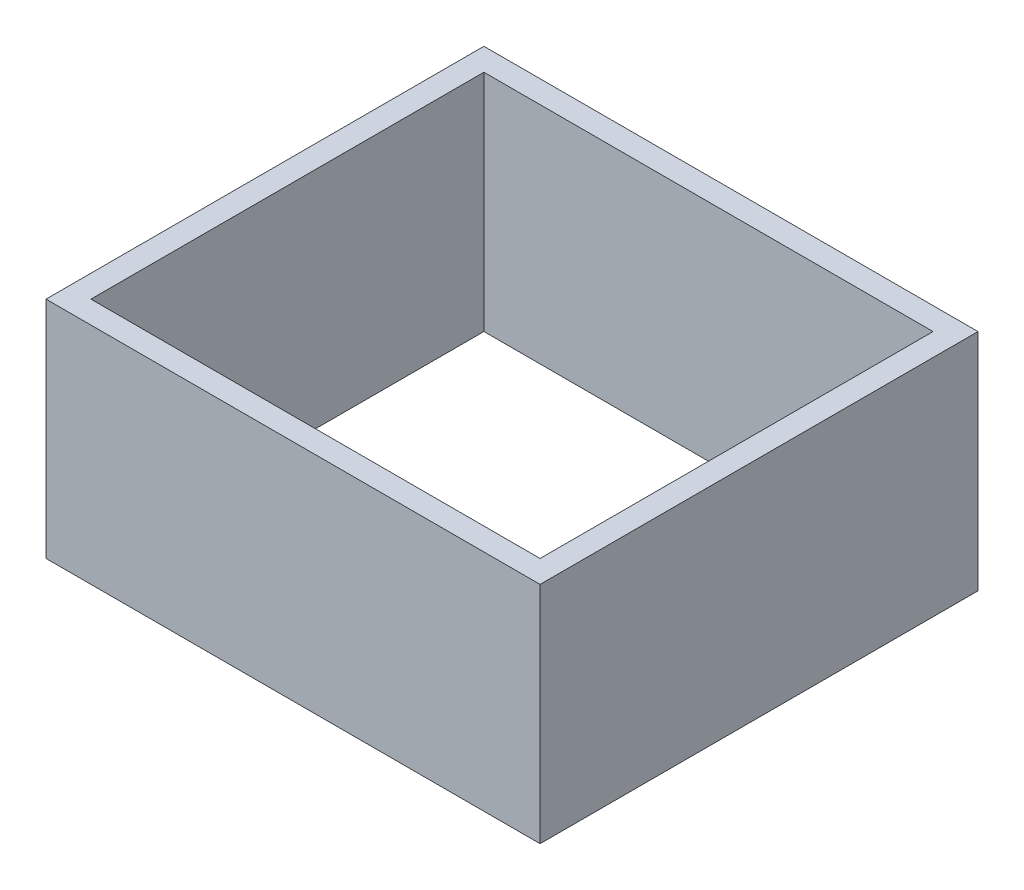
ISO-10303-21;
HEADER;
FILE_DESCRIPTION(('STEP AP214'),'2;1');
FILE_NAME('part.step','',(''),(''),'','','');
FILE_SCHEMA(('AUTOMOTIVE_DESIGN { 1 0 10303 214 1 1 1 1 }'));
ENDSEC;
DATA;
#1=APPLICATION_CONTEXT('core data for automotive mechanical design processes');
#2=APPLICATION_PROTOCOL_DEFINITION('international standard','automotive_design',2000,#1);
#3=PRODUCT_CONTEXT('',#1,'mechanical');
#4=PRODUCT('Part','Part','',(#3));
#5=PRODUCT_RELATED_PRODUCT_CATEGORY('part','',(#4));
#6=PRODUCT_DEFINITION_FORMATION('','',#4);
#7=PRODUCT_DEFINITION_CONTEXT('part definition',#1,'design');
#8=PRODUCT_DEFINITION('design','',#6,#7);
#9=PRODUCT_DEFINITION_SHAPE('','',#8);
#10=(LENGTH_UNIT() NAMED_UNIT(*) SI_UNIT(.MILLI.,.METRE.));
#11=(NAMED_UNIT(*) PLANE_ANGLE_UNIT() SI_UNIT($,.RADIAN.));
#12=(NAMED_UNIT(*) SI_UNIT($,.STERADIAN.) SOLID_ANGLE_UNIT());
#13=UNCERTAINTY_MEASURE_WITH_UNIT(LENGTH_MEASURE(1.E-05),#10,'distance_accuracy_value','');
#14=(GEOMETRIC_REPRESENTATION_CONTEXT(3) GLOBAL_UNCERTAINTY_ASSIGNED_CONTEXT((#13)) GLOBAL_UNIT_ASSIGNED_CONTEXT((#10,
#11,#12)) REPRESENTATION_CONTEXT('',''));
#15=CARTESIAN_POINT('',(0.,0.,0.));
#16=DIRECTION('',(0.,0.,1.));
#17=DIRECTION('',(1.,0.,0.));
#18=AXIS2_PLACEMENT_3D('',#15,#16,#17);
#19=CARTESIAN_POINT('',(-30.9749321294389,25.4,-35.6226457399103));
#20=DIRECTION('',(0.,0.,-1.));
#21=DIRECTION('',(-1.,0.,0.));
#22=AXIS2_PLACEMENT_3D('',#19,#20,#21);
#23=PLANE('',#22);
#24=DIRECTION('',(1.,0.,0.));
#25=VECTOR('',#24,1.);
#26=CARTESIAN_POINT('',(-30.9749321294389,0.,-35.6226457399103));
#27=LINE('',#26,#25);
#28=CARTESIAN_POINT('',(-30.9749321294389,0.,-35.6226457399103));
#29=VERTEX_POINT('',#28);
#30=CARTESIAN_POINT('',(24.9050678705612,0.,-35.6226457399103));
#31=VERTEX_POINT('',#30);
#32=EDGE_CURVE('E148',#29,#31,#27,.T.);
#33=ORIENTED_EDGE('',*,*,#32,.F.);
#34=DIRECTION('',(0.,-1.,0.));
#35=VECTOR('',#34,1.);
#36=CARTESIAN_POINT('',(-30.9749321294389,25.4,-35.6226457399103));
#37=LINE('',#36,#35);
#38=CARTESIAN_POINT('',(-30.9749321294389,25.4,-35.6226457399103));
#39=VERTEX_POINT('',#38);
#40=EDGE_CURVE('E11',#39,#29,#37,.T.);
#41=ORIENTED_EDGE('',*,*,#40,.F.);
#42=DIRECTION('',(1.,0.,0.));
#43=VECTOR('',#42,1.);
#44=CARTESIAN_POINT('',(-30.9749321294389,25.4,-35.6226457399103));
#45=LINE('',#44,#43);
#46=CARTESIAN_POINT('',(24.9050678705612,25.4,-35.6226457399103));
#47=VERTEX_POINT('',#46);
#48=EDGE_CURVE('E154',#39,#47,#45,.T.);
#49=ORIENTED_EDGE('',*,*,#48,.T.);
#50=DIRECTION('',(0.,-1.,0.));
#51=VECTOR('',#50,1.);
#52=CARTESIAN_POINT('',(24.9050678705612,25.4,-35.6226457399103));
#53=LINE('',#52,#51);
#54=EDGE_CURVE('E42',#47,#31,#53,.T.);
#55=ORIENTED_EDGE('',*,*,#54,.T.);
#56=EDGE_LOOP('',(#33,#41,#49,#55));
#57=FACE_BOUND('',#56,.T.);
#58=ADVANCED_FACE('F39',(#57),#23,.T.);
#59=CARTESIAN_POINT('',(-30.9749321294389,25.4,-35.6226457399103));
#60=DIRECTION('',(1.,0.,0.));
#61=DIRECTION('',(0.,0.,-1.));
#62=AXIS2_PLACEMENT_3D('',#59,#60,#61);
#63=PLANE('',#62);
#64=DIRECTION('',(0.,0.,1.));
#65=VECTOR('',#64,1.);
#66=CARTESIAN_POINT('',(-30.9749321294389,0.,-35.6226457399103));
#67=LINE('',#66,#65);
#68=CARTESIAN_POINT('',(-30.9749321294388,0.,13.9073542600897));
#69=VERTEX_POINT('',#68);
#70=EDGE_CURVE('E159',#29,#69,#67,.T.);
#71=ORIENTED_EDGE('',*,*,#70,.T.);
#72=DIRECTION('',(0.,-1.,0.));
#73=VECTOR('',#72,1.);
#74=CARTESIAN_POINT('',(-30.9749321294388,25.4,13.9073542600897));
#75=LINE('',#74,#73);
#76=CARTESIAN_POINT('',(-30.9749321294388,25.4,13.9073542600897));
#77=VERTEX_POINT('',#76);
#78=EDGE_CURVE('E48',#77,#69,#75,.T.);
#79=ORIENTED_EDGE('',*,*,#78,.F.);
#80=DIRECTION('',(0.,0.,1.));
#81=VECTOR('',#80,1.);
#82=CARTESIAN_POINT('',(-30.9749321294389,25.4,-35.6226457399103));
#83=LINE('',#82,#81);
#84=EDGE_CURVE('E167',#39,#77,#83,.T.);
#85=ORIENTED_EDGE('',*,*,#84,.F.);
#86=ORIENTED_EDGE('',*,*,#40,.T.);
#87=EDGE_LOOP('',(#71,#79,#85,#86));
#88=FACE_BOUND('',#87,.T.);
#89=ADVANCED_FACE('F199',(#88),#63,.F.);
#90=CARTESIAN_POINT('',(24.9050678705612,25.4,13.9073542600897));
#91=DIRECTION('',(0.,0.,1.));
#92=DIRECTION('',(1.,0.,0.));
#93=AXIS2_PLACEMENT_3D('',#90,#91,#92);
#94=PLANE('',#93);
#95=DIRECTION('',(-1.,0.,0.));
#96=VECTOR('',#95,1.);
#97=CARTESIAN_POINT('',(24.9050678705612,0.,13.9073542600897));
#98=LINE('',#97,#96);
#99=CARTESIAN_POINT('',(24.9050678705612,0.,13.9073542600897));
#100=VERTEX_POINT('',#99);
#101=EDGE_CURVE('E177',#100,#69,#98,.T.);
#102=ORIENTED_EDGE('',*,*,#101,.F.);
#103=DIRECTION('',(0.,-1.,0.));
#104=VECTOR('',#103,1.);
#105=CARTESIAN_POINT('',(24.9050678705612,25.4,13.9073542600897));
#106=LINE('',#105,#104);
#107=CARTESIAN_POINT('',(24.9050678705612,25.4,13.9073542600897));
#108=VERTEX_POINT('',#107);
#109=EDGE_CURVE('E185',#108,#100,#106,.T.);
#110=ORIENTED_EDGE('',*,*,#109,.F.);
#111=DIRECTION('',(-1.,0.,0.));
#112=VECTOR('',#111,1.);
#113=CARTESIAN_POINT('',(24.9050678705612,25.4,13.9073542600897));
#114=LINE('',#113,#112);
#115=EDGE_CURVE('E163',#108,#77,#114,.T.);
#116=ORIENTED_EDGE('',*,*,#115,.T.);
#117=ORIENTED_EDGE('',*,*,#78,.T.);
#118=EDGE_LOOP('',(#102,#110,#116,#117));
#119=FACE_BOUND('',#118,.T.);
#120=ADVANCED_FACE('F205',(#119),#94,.T.);
#121=CARTESIAN_POINT('',(24.9050678705612,25.4,-35.6226457399103));
#122=DIRECTION('',(1.,0.,0.));
#123=DIRECTION('',(0.,0.,-1.));
#124=AXIS2_PLACEMENT_3D('',#121,#122,#123);
#125=PLANE('',#124);
#126=DIRECTION('',(0.,0.,1.));
#127=VECTOR('',#126,1.);
#128=CARTESIAN_POINT('',(24.9050678705612,0.,-35.6226457399103));
#129=LINE('',#128,#127);
#130=EDGE_CURVE('E173',#31,#100,#129,.T.);
#131=ORIENTED_EDGE('',*,*,#130,.F.);
#132=ORIENTED_EDGE('',*,*,#54,.F.);
#133=DIRECTION('',(0.,0.,1.));
#134=VECTOR('',#133,1.);
#135=CARTESIAN_POINT('',(24.9050678705612,25.4,-35.6226457399103));
#136=LINE('',#135,#134);
#137=EDGE_CURVE('E158',#47,#108,#136,.T.);
#138=ORIENTED_EDGE('',*,*,#137,.T.);
#139=ORIENTED_EDGE('',*,*,#109,.T.);
#140=EDGE_LOOP('',(#131,#132,#138,#139));
#141=FACE_BOUND('',#140,.T.);
#142=ADVANCED_FACE('F195',(#141),#125,.T.);
#143=CARTESIAN_POINT('',(0.,25.4,0.));
#144=DIRECTION('',(0.,-1.,0.));
#145=DIRECTION('',(0.,0.,-1.));
#146=AXIS2_PLACEMENT_3D('',#143,#144,#145);
#147=PLANE('',#146);
#148=DIRECTION('',(1.,0.,0.));
#149=VECTOR('',#148,1.);
#150=CARTESIAN_POINT('',(-28.4349321294388,25.4,11.3673542600897));
#151=LINE('',#150,#149);
#152=CARTESIAN_POINT('',(-28.4349321294388,25.4,11.3673542600897));
#153=VERTEX_POINT('',#152);
#154=CARTESIAN_POINT('',(22.3650678705612,25.4,11.3673542600897));
#155=VERTEX_POINT('',#154);
#156=EDGE_CURVE('E139',#153,#155,#151,.T.);
#157=ORIENTED_EDGE('',*,*,#156,.F.);
#158=DIRECTION('',(0.,0.,1.));
#159=VECTOR('',#158,1.);
#160=CARTESIAN_POINT('',(-28.4349321294389,25.4,-33.0826457399103));
#161=LINE('',#160,#159);
#162=CARTESIAN_POINT('',(-28.4349321294389,25.4,-33.0826457399103));
#163=VERTEX_POINT('',#162);
#164=EDGE_CURVE('E56',#163,#153,#161,.T.);
#165=ORIENTED_EDGE('',*,*,#164,.F.);
#166=DIRECTION('',(-1.,0.,0.));
#167=VECTOR('',#166,1.);
#168=CARTESIAN_POINT('',(-28.4349321294389,25.4,-33.0826457399103));
#169=LINE('',#168,#167);
#170=CARTESIAN_POINT('',(22.3650678705612,25.4,-33.0826457399103));
#171=VERTEX_POINT('',#170);
#172=EDGE_CURVE('E126',#171,#163,#169,.T.);
#173=ORIENTED_EDGE('',*,*,#172,.F.);
#174=DIRECTION('',(0.,0.,-1.));
#175=VECTOR('',#174,1.);
#176=CARTESIAN_POINT('',(22.3650678705612,25.4,-33.0826457399103));
#177=LINE('',#176,#175);
#178=EDGE_CURVE('E130',#155,#171,#177,.T.);
#179=ORIENTED_EDGE('',*,*,#178,.F.);
#180=EDGE_LOOP('',(#157,#165,#173,#179));
#181=FACE_BOUND('',#180,.T.);
#182=ORIENTED_EDGE('',*,*,#48,.F.);
#183=ORIENTED_EDGE('',*,*,#84,.T.);
#184=ORIENTED_EDGE('',*,*,#115,.F.);
#185=ORIENTED_EDGE('',*,*,#137,.F.);
#186=EDGE_LOOP('',(#182,#183,#184,#185));
#187=FACE_BOUND('',#186,.T.);
#188=ADVANCED_FACE('F203',(#181,#187),#147,.F.);
#189=CARTESIAN_POINT('',(0.,0.,0.));
#190=DIRECTION('',(0.,-1.,0.));
#191=DIRECTION('',(0.,0.,-1.));
#192=AXIS2_PLACEMENT_3D('',#189,#190,#191);
#193=PLANE('',#192);
#194=DIRECTION('',(0.,0.,1.));
#195=VECTOR('',#194,1.);
#196=CARTESIAN_POINT('',(-28.4349321294389,0.,-33.0826457399103));
#197=LINE('',#196,#195);
#198=CARTESIAN_POINT('',(-28.4349321294389,0.,-33.0826457399103));
#199=VERTEX_POINT('',#198);
#200=CARTESIAN_POINT('',(-28.4349321294388,0.,11.3673542600897));
#201=VERTEX_POINT('',#200);
#202=EDGE_CURVE('E107',#199,#201,#197,.T.);
#203=ORIENTED_EDGE('',*,*,#202,.T.);
#204=DIRECTION('',(1.,0.,0.));
#205=VECTOR('',#204,1.);
#206=CARTESIAN_POINT('',(-28.4349321294388,0.,11.3673542600897));
#207=LINE('',#206,#205);
#208=CARTESIAN_POINT('',(22.3650678705612,0.,11.3673542600897));
#209=VERTEX_POINT('',#208);
#210=EDGE_CURVE('E117',#201,#209,#207,.T.);
#211=ORIENTED_EDGE('',*,*,#210,.T.);
#212=DIRECTION('',(0.,0.,-1.));
#213=VECTOR('',#212,1.);
#214=CARTESIAN_POINT('',(22.3650678705612,0.,-33.0826457399103));
#215=LINE('',#214,#213);
#216=CARTESIAN_POINT('',(22.3650678705612,0.,-33.0826457399103));
#217=VERTEX_POINT('',#216);
#218=EDGE_CURVE('E64',#209,#217,#215,.T.);
#219=ORIENTED_EDGE('',*,*,#218,.T.);
#220=DIRECTION('',(-1.,0.,0.));
#221=VECTOR('',#220,1.);
#222=CARTESIAN_POINT('',(-28.4349321294389,0.,-33.0826457399103));
#223=LINE('',#222,#221);
#224=EDGE_CURVE('E114',#217,#199,#223,.T.);
#225=ORIENTED_EDGE('',*,*,#224,.T.);
#226=EDGE_LOOP('',(#203,#211,#219,#225));
#227=FACE_BOUND('',#226,.T.);
#228=ORIENTED_EDGE('',*,*,#32,.T.);
#229=ORIENTED_EDGE('',*,*,#130,.T.);
#230=ORIENTED_EDGE('',*,*,#101,.T.);
#231=ORIENTED_EDGE('',*,*,#70,.F.);
#232=EDGE_LOOP('',(#228,#229,#230,#231));
#233=FACE_BOUND('',#232,.T.);
#234=ADVANCED_FACE('F122',(#227,#233),#193,.T.);
#235=CARTESIAN_POINT('',(-28.4349321294389,0.,-33.0826457399103));
#236=DIRECTION('',(-1.,0.,0.));
#237=DIRECTION('',(0.,0.,1.));
#238=AXIS2_PLACEMENT_3D('',#235,#236,#237);
#239=PLANE('',#238);
#240=ORIENTED_EDGE('',*,*,#164,.T.);
#241=DIRECTION('',(0.,1.,0.));
#242=VECTOR('',#241,1.);
#243=CARTESIAN_POINT('',(-28.4349321294388,0.,11.3673542600897));
#244=LINE('',#243,#242);
#245=EDGE_CURVE('E103',#201,#153,#244,.T.);
#246=ORIENTED_EDGE('',*,*,#245,.F.);
#247=ORIENTED_EDGE('',*,*,#202,.F.);
#248=DIRECTION('',(0.,1.,0.));
#249=VECTOR('',#248,1.);
#250=CARTESIAN_POINT('',(-28.4349321294389,0.,-33.0826457399103));
#251=LINE('',#250,#249);
#252=EDGE_CURVE('E145',#199,#163,#251,.T.);
#253=ORIENTED_EDGE('',*,*,#252,.T.);
#254=EDGE_LOOP('',(#240,#246,#247,#253));
#255=FACE_BOUND('',#254,.T.);
#256=ADVANCED_FACE('F105',(#255),#239,.F.);
#257=CARTESIAN_POINT('',(-28.4349321294389,0.,-33.0826457399103));
#258=DIRECTION('',(0.,0.,-1.));
#259=DIRECTION('',(-1.,0.,0.));
#260=AXIS2_PLACEMENT_3D('',#257,#258,#259);
#261=PLANE('',#260);
#262=ORIENTED_EDGE('',*,*,#172,.T.);
#263=ORIENTED_EDGE('',*,*,#252,.F.);
#264=ORIENTED_EDGE('',*,*,#224,.F.);
#265=DIRECTION('',(0.,1.,0.));
#266=VECTOR('',#265,1.);
#267=CARTESIAN_POINT('',(22.3650678705612,0.,-33.0826457399103));
#268=LINE('',#267,#266);
#269=EDGE_CURVE('E149',#217,#171,#268,.T.);
#270=ORIENTED_EDGE('',*,*,#269,.T.);
#271=EDGE_LOOP('',(#262,#263,#264,#270));
#272=FACE_BOUND('',#271,.T.);
#273=ADVANCED_FACE('F256',(#272),#261,.F.);
#274=CARTESIAN_POINT('',(22.3650678705612,0.,-33.0826457399103));
#275=DIRECTION('',(1.,0.,0.));
#276=DIRECTION('',(0.,0.,-1.));
#277=AXIS2_PLACEMENT_3D('',#274,#275,#276);
#278=PLANE('',#277);
#279=ORIENTED_EDGE('',*,*,#178,.T.);
#280=ORIENTED_EDGE('',*,*,#269,.F.);
#281=ORIENTED_EDGE('',*,*,#218,.F.);
#282=DIRECTION('',(0.,1.,0.));
#283=VECTOR('',#282,1.);
#284=CARTESIAN_POINT('',(22.3650678705612,0.,11.3673542600897));
#285=LINE('',#284,#283);
#286=EDGE_CURVE('E113',#209,#155,#285,.T.);
#287=ORIENTED_EDGE('',*,*,#286,.T.);
#288=EDGE_LOOP('',(#279,#280,#281,#287));
#289=FACE_BOUND('',#288,.T.);
#290=ADVANCED_FACE('F265',(#289),#278,.F.);
#291=CARTESIAN_POINT('',(-28.4349321294388,0.,11.3673542600897));
#292=DIRECTION('',(0.,0.,1.));
#293=DIRECTION('',(1.,0.,0.));
#294=AXIS2_PLACEMENT_3D('',#291,#292,#293);
#295=PLANE('',#294);
#296=ORIENTED_EDGE('',*,*,#156,.T.);
#297=ORIENTED_EDGE('',*,*,#286,.F.);
#298=ORIENTED_EDGE('',*,*,#210,.F.);
#299=ORIENTED_EDGE('',*,*,#245,.T.);
#300=EDGE_LOOP('',(#296,#297,#298,#299));
#301=FACE_BOUND('',#300,.T.);
#302=ADVANCED_FACE('F118',(#301),#295,.F.);
#303=CLOSED_SHELL('',(#58,#89,#120,#142,#188,#234,#256,#273,#290,#302));
#304=MANIFOLD_SOLID_BREP('B2',#303);
#305=ADVANCED_BREP_SHAPE_REPRESENTATION('',(#18,#304),#14);
#306=SHAPE_DEFINITION_REPRESENTATION(#9,#305);
ENDSEC;
END-ISO-10303-21;
